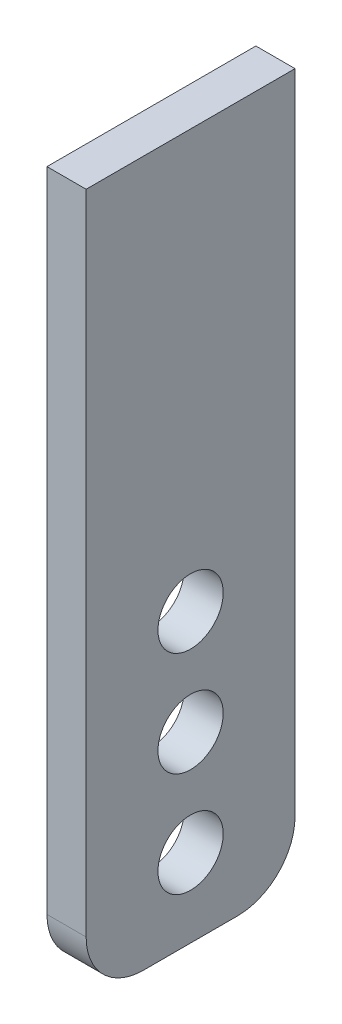
ISO-10303-21;
HEADER;
FILE_DESCRIPTION(('STEP AP214'),'2;1');
FILE_NAME('part.step','',(''),(''),'','','');
FILE_SCHEMA(('AUTOMOTIVE_DESIGN { 1 0 10303 214 1 1 1 1 }'));
ENDSEC;
DATA;
#1=APPLICATION_CONTEXT('core data for automotive mechanical design processes');
#2=APPLICATION_PROTOCOL_DEFINITION('international standard','automotive_design',2000,#1);
#3=PRODUCT_CONTEXT('',#1,'mechanical');
#4=PRODUCT('Part','Part','',(#3));
#5=PRODUCT_RELATED_PRODUCT_CATEGORY('part','',(#4));
#6=PRODUCT_DEFINITION_FORMATION('','',#4);
#7=PRODUCT_DEFINITION_CONTEXT('part definition',#1,'design');
#8=PRODUCT_DEFINITION('design','',#6,#7);
#9=PRODUCT_DEFINITION_SHAPE('','',#8);
#10=(LENGTH_UNIT() NAMED_UNIT(*) SI_UNIT(.MILLI.,.METRE.));
#11=(NAMED_UNIT(*) PLANE_ANGLE_UNIT() SI_UNIT($,.RADIAN.));
#12=(NAMED_UNIT(*) SI_UNIT($,.STERADIAN.) SOLID_ANGLE_UNIT());
#13=UNCERTAINTY_MEASURE_WITH_UNIT(LENGTH_MEASURE(1.E-05),#10,'distance_accuracy_value','');
#14=(GEOMETRIC_REPRESENTATION_CONTEXT(3) GLOBAL_UNCERTAINTY_ASSIGNED_CONTEXT((#13)) GLOBAL_UNIT_ASSIGNED_CONTEXT((#10,
#11,#12)) REPRESENTATION_CONTEXT('',''));
#15=CARTESIAN_POINT('',(0.,0.,0.));
#16=DIRECTION('',(0.,0.,1.));
#17=DIRECTION('',(1.,0.,0.));
#18=AXIS2_PLACEMENT_3D('',#15,#16,#17);
#19=CARTESIAN_POINT('',(-750.001,-200.,620.5));
#20=DIRECTION('',(1.,0.,0.));
#21=DIRECTION('',(0.,1.,0.));
#22=AXIS2_PLACEMENT_3D('',#19,#20,#21);
#23=CYLINDRICAL_SURFACE('',#22,12.5);
#24=CARTESIAN_POINT('',(342.5,-200.,620.5));
#25=DIRECTION('',(1.,0.,0.));
#26=DIRECTION('',(0.,1.,0.));
#27=AXIS2_PLACEMENT_3D('',#24,#25,#26);
#28=CIRCLE('',#27,12.5);
#29=CARTESIAN_POINT('',(342.5,-187.5,620.5));
#30=VERTEX_POINT('',#29);
#31=EDGE_CURVE('E46',#30,#30,#28,.T.);
#32=ORIENTED_EDGE('',*,*,#31,.T.);
#33=EDGE_LOOP('',(#32));
#34=FACE_BOUND('',#33,.T.);
#35=CARTESIAN_POINT('',(327.5,-200.,620.5));
#36=DIRECTION('',(1.,0.,0.));
#37=DIRECTION('',(0.,1.,0.));
#38=AXIS2_PLACEMENT_3D('',#35,#36,#37);
#39=CIRCLE('',#38,12.5);
#40=CARTESIAN_POINT('',(327.5,-187.5,620.5));
#41=VERTEX_POINT('',#40);
#42=EDGE_CURVE('E11',#41,#41,#39,.F.);
#43=ORIENTED_EDGE('',*,*,#42,.T.);
#44=EDGE_LOOP('',(#43));
#45=FACE_BOUND('',#44,.T.);
#46=ADVANCED_FACE('F38',(#34,#45),#23,.F.);
#47=CARTESIAN_POINT('',(342.5,-310.,580.5));
#48=DIRECTION('',(0.,0.,1.));
#49=DIRECTION('',(1.,0.,0.));
#50=AXIS2_PLACEMENT_3D('',#47,#48,#49);
#51=PLANE('',#50);
#52=DIRECTION('',(0.,1.,0.));
#53=VECTOR('',#52,1.);
#54=CARTESIAN_POINT('',(342.5,-310.,580.5));
#55=LINE('',#54,#53);
#56=CARTESIAN_POINT('',(342.5,-288.,580.5));
#57=VERTEX_POINT('',#56);
#58=CARTESIAN_POINT('',(342.5,-40.,580.5));
#59=VERTEX_POINT('',#58);
#60=EDGE_CURVE('E91',#57,#59,#55,.T.);
#61=ORIENTED_EDGE('',*,*,#60,.F.);
#62=DIRECTION('',(1.,0.,0.));
#63=VECTOR('',#62,1.);
#64=CARTESIAN_POINT('',(342.5,-288.,580.5));
#65=LINE('',#64,#63);
#66=CARTESIAN_POINT('',(327.5,-288.,580.5));
#67=VERTEX_POINT('',#66);
#68=EDGE_CURVE('E61',#57,#67,#65,.F.);
#69=ORIENTED_EDGE('',*,*,#68,.T.);
#70=DIRECTION('',(0.,1.,0.));
#71=VECTOR('',#70,1.);
#72=CARTESIAN_POINT('',(327.5,-310.,580.5));
#73=LINE('',#72,#71);
#74=CARTESIAN_POINT('',(327.5,-40.,580.5));
#75=VERTEX_POINT('',#74);
#76=EDGE_CURVE('E115',#67,#75,#73,.T.);
#77=ORIENTED_EDGE('',*,*,#76,.T.);
#78=DIRECTION('',(1.,0.,0.));
#79=VECTOR('',#78,1.);
#80=CARTESIAN_POINT('',(342.5,-40.,580.5));
#81=LINE('',#80,#79);
#82=EDGE_CURVE('E109',#75,#59,#81,.T.);
#83=ORIENTED_EDGE('',*,*,#82,.T.);
#84=EDGE_LOOP('',(#61,#69,#77,#83));
#85=FACE_BOUND('',#84,.T.);
#86=ADVANCED_FACE('F114',(#85),#51,.F.);
#87=CARTESIAN_POINT('',(342.5,-310.,580.5));
#88=DIRECTION('',(-1.,0.,0.));
#89=DIRECTION('',(0.,-1.,0.));
#90=AXIS2_PLACEMENT_3D('',#87,#88,#89);
#91=PLANE('',#90);
#92=CARTESIAN_POINT('',(342.5,-240.,620.5));
#93=DIRECTION('',(1.,0.,0.));
#94=DIRECTION('',(0.,1.,0.));
#95=AXIS2_PLACEMENT_3D('',#92,#93,#94);
#96=CIRCLE('',#95,12.5);
#97=CARTESIAN_POINT('',(342.5,-227.5,620.5));
#98=VERTEX_POINT('',#97);
#99=EDGE_CURVE('E297',#98,#98,#96,.T.);
#100=ORIENTED_EDGE('',*,*,#99,.F.);
#101=EDGE_LOOP('',(#100));
#102=FACE_BOUND('',#101,.T.);
#103=CARTESIAN_POINT('',(342.5,-280.,620.5));
#104=DIRECTION('',(1.,0.,0.));
#105=DIRECTION('',(0.,1.,0.));
#106=AXIS2_PLACEMENT_3D('',#103,#104,#105);
#107=CIRCLE('',#106,12.5);
#108=CARTESIAN_POINT('',(342.5,-267.5,620.5));
#109=VERTEX_POINT('',#108);
#110=EDGE_CURVE('E123',#109,#109,#107,.T.);
#111=ORIENTED_EDGE('',*,*,#110,.F.);
#112=EDGE_LOOP('',(#111));
#113=FACE_BOUND('',#112,.T.);
#114=DIRECTION('',(0.,0.,1.));
#115=VECTOR('',#114,1.);
#116=CARTESIAN_POINT('',(342.5,-310.,580.5));
#117=LINE('',#116,#115);
#118=CARTESIAN_POINT('',(342.5,-310.,602.5));
#119=VERTEX_POINT('',#118);
#120=CARTESIAN_POINT('',(342.5,-310.,638.5));
#121=VERTEX_POINT('',#120);
#122=EDGE_CURVE('E134',#119,#121,#117,.T.);
#123=ORIENTED_EDGE('',*,*,#122,.F.);
#124=CARTESIAN_POINT('',(342.5,-288.,602.5));
#125=DIRECTION('',(-1.,0.,0.));
#126=DIRECTION('',(0.,-1.,0.));
#127=AXIS2_PLACEMENT_3D('',#124,#125,#126);
#128=CIRCLE('',#127,22.);
#129=EDGE_CURVE('E99',#119,#57,#128,.F.);
#130=ORIENTED_EDGE('',*,*,#129,.T.);
#131=ORIENTED_EDGE('',*,*,#60,.T.);
#132=DIRECTION('',(0.,0.,1.));
#133=VECTOR('',#132,1.);
#134=CARTESIAN_POINT('',(342.5,-40.,580.5));
#135=LINE('',#134,#133);
#136=CARTESIAN_POINT('',(342.5,-40.,660.5));
#137=VERTEX_POINT('',#136);
#138=EDGE_CURVE('E97',#59,#137,#135,.T.);
#139=ORIENTED_EDGE('',*,*,#138,.T.);
#140=DIRECTION('',(0.,1.,0.));
#141=VECTOR('',#140,1.);
#142=CARTESIAN_POINT('',(342.5,-310.,660.5));
#143=LINE('',#142,#141);
#144=CARTESIAN_POINT('',(342.5,-288.,660.5));
#145=VERTEX_POINT('',#144);
#146=EDGE_CURVE('E103',#145,#137,#143,.T.);
#147=ORIENTED_EDGE('',*,*,#146,.F.);
#148=CARTESIAN_POINT('',(342.5,-288.,638.5));
#149=DIRECTION('',(-1.,0.,0.));
#150=DIRECTION('',(0.,-1.,0.));
#151=AXIS2_PLACEMENT_3D('',#148,#149,#150);
#152=CIRCLE('',#151,22.);
#153=EDGE_CURVE('E149',#145,#121,#152,.F.);
#154=ORIENTED_EDGE('',*,*,#153,.T.);
#155=EDGE_LOOP('',(#123,#130,#131,#139,#147,#154));
#156=FACE_BOUND('',#155,.T.);
#157=ORIENTED_EDGE('',*,*,#31,.F.);
#158=EDGE_LOOP('',(#157));
#159=FACE_BOUND('',#158,.T.);
#160=ADVANCED_FACE('F94',(#102,#113,#156,#159),#91,.F.);
#161=CARTESIAN_POINT('',(327.5,-310.,660.5));
#162=DIRECTION('',(0.,0.,-1.));
#163=DIRECTION('',(-1.,0.,0.));
#164=AXIS2_PLACEMENT_3D('',#161,#162,#163);
#165=PLANE('',#164);
#166=DIRECTION('',(0.,1.,0.));
#167=VECTOR('',#166,1.);
#168=CARTESIAN_POINT('',(327.5,-310.,660.5));
#169=LINE('',#168,#167);
#170=CARTESIAN_POINT('',(327.5,-288.,660.5));
#171=VERTEX_POINT('',#170);
#172=CARTESIAN_POINT('',(327.5,-40.,660.5));
#173=VERTEX_POINT('',#172);
#174=EDGE_CURVE('E137',#171,#173,#169,.T.);
#175=ORIENTED_EDGE('',*,*,#174,.F.);
#176=DIRECTION('',(-1.,0.,0.));
#177=VECTOR('',#176,1.);
#178=CARTESIAN_POINT('',(327.5,-288.,660.5));
#179=LINE('',#178,#177);
#180=EDGE_CURVE('E161',#171,#145,#179,.F.);
#181=ORIENTED_EDGE('',*,*,#180,.T.);
#182=ORIENTED_EDGE('',*,*,#146,.T.);
#183=DIRECTION('',(-1.,0.,0.));
#184=VECTOR('',#183,1.);
#185=CARTESIAN_POINT('',(327.5,-40.,660.5));
#186=LINE('',#185,#184);
#187=EDGE_CURVE('E111',#137,#173,#186,.T.);
#188=ORIENTED_EDGE('',*,*,#187,.T.);
#189=EDGE_LOOP('',(#175,#181,#182,#188));
#190=FACE_BOUND('',#189,.T.);
#191=ADVANCED_FACE('F171',(#190),#165,.F.);
#192=CARTESIAN_POINT('',(327.5,-310.,580.5));
#193=DIRECTION('',(1.,0.,0.));
#194=DIRECTION('',(0.,1.,0.));
#195=AXIS2_PLACEMENT_3D('',#192,#193,#194);
#196=PLANE('',#195);
#197=CARTESIAN_POINT('',(327.5,-240.,620.5));
#198=DIRECTION('',(1.,0.,0.));
#199=DIRECTION('',(0.,1.,0.));
#200=AXIS2_PLACEMENT_3D('',#197,#198,#199);
#201=CIRCLE('',#200,12.5);
#202=CARTESIAN_POINT('',(327.5,-227.5,620.5));
#203=VERTEX_POINT('',#202);
#204=EDGE_CURVE('E300',#203,#203,#201,.F.);
#205=ORIENTED_EDGE('',*,*,#204,.F.);
#206=EDGE_LOOP('',(#205));
#207=FACE_BOUND('',#206,.T.);
#208=CARTESIAN_POINT('',(327.5,-280.,620.5));
#209=DIRECTION('',(1.,0.,0.));
#210=DIRECTION('',(0.,1.,0.));
#211=AXIS2_PLACEMENT_3D('',#208,#209,#210);
#212=CIRCLE('',#211,12.5);
#213=CARTESIAN_POINT('',(327.5,-267.5,620.5));
#214=VERTEX_POINT('',#213);
#215=EDGE_CURVE('E118',#214,#214,#212,.F.);
#216=ORIENTED_EDGE('',*,*,#215,.F.);
#217=EDGE_LOOP('',(#216));
#218=FACE_BOUND('',#217,.T.);
#219=ORIENTED_EDGE('',*,*,#76,.F.);
#220=CARTESIAN_POINT('',(327.5,-288.,602.5));
#221=DIRECTION('',(1.,0.,0.));
#222=DIRECTION('',(0.,1.,0.));
#223=AXIS2_PLACEMENT_3D('',#220,#221,#222);
#224=CIRCLE('',#223,22.);
#225=CARTESIAN_POINT('',(327.5,-310.,602.5));
#226=VERTEX_POINT('',#225);
#227=EDGE_CURVE('E158',#67,#226,#224,.F.);
#228=ORIENTED_EDGE('',*,*,#227,.T.);
#229=DIRECTION('',(0.,0.,-1.));
#230=VECTOR('',#229,1.);
#231=CARTESIAN_POINT('',(327.5,-310.,580.5));
#232=LINE('',#231,#230);
#233=CARTESIAN_POINT('',(327.5,-310.,638.5));
#234=VERTEX_POINT('',#233);
#235=EDGE_CURVE('E126',#234,#226,#232,.T.);
#236=ORIENTED_EDGE('',*,*,#235,.F.);
#237=CARTESIAN_POINT('',(327.5,-288.,638.5));
#238=DIRECTION('',(1.,0.,0.));
#239=DIRECTION('',(0.,1.,0.));
#240=AXIS2_PLACEMENT_3D('',#237,#238,#239);
#241=CIRCLE('',#240,22.);
#242=EDGE_CURVE('E53',#234,#171,#241,.F.);
#243=ORIENTED_EDGE('',*,*,#242,.T.);
#244=ORIENTED_EDGE('',*,*,#174,.T.);
#245=DIRECTION('',(0.,0.,-1.));
#246=VECTOR('',#245,1.);
#247=CARTESIAN_POINT('',(327.5,-40.,580.5));
#248=LINE('',#247,#246);
#249=EDGE_CURVE('E131',#173,#75,#248,.T.);
#250=ORIENTED_EDGE('',*,*,#249,.T.);
#251=EDGE_LOOP('',(#219,#228,#236,#243,#244,#250));
#252=FACE_BOUND('',#251,.T.);
#253=ORIENTED_EDGE('',*,*,#42,.F.);
#254=EDGE_LOOP('',(#253));
#255=FACE_BOUND('',#254,.T.);
#256=ADVANCED_FACE('F178',(#207,#218,#252,#255),#196,.F.);
#257=CARTESIAN_POINT('',(1.11022302462516E-13,-310.,0.));
#258=DIRECTION('',(0.,1.,0.));
#259=DIRECTION('',(0.,0.,1.));
#260=AXIS2_PLACEMENT_3D('',#257,#258,#259);
#261=PLANE('',#260);
#262=ORIENTED_EDGE('',*,*,#235,.T.);
#263=DIRECTION('',(1.,0.,0.));
#264=VECTOR('',#263,1.);
#265=CARTESIAN_POINT('',(1.11022302462516E-13,-310.,602.5));
#266=LINE('',#265,#264);
#267=EDGE_CURVE('E145',#226,#119,#266,.T.);
#268=ORIENTED_EDGE('',*,*,#267,.T.);
#269=ORIENTED_EDGE('',*,*,#122,.T.);
#270=DIRECTION('',(-1.,0.,0.));
#271=VECTOR('',#270,1.);
#272=CARTESIAN_POINT('',(1.11022302462516E-13,-310.,638.5));
#273=LINE('',#272,#271);
#274=EDGE_CURVE('E102',#121,#234,#273,.T.);
#275=ORIENTED_EDGE('',*,*,#274,.T.);
#276=EDGE_LOOP('',(#262,#268,#269,#275));
#277=FACE_BOUND('',#276,.T.);
#278=ADVANCED_FACE('F215',(#277),#261,.F.);
#279=CARTESIAN_POINT('',(0.,-40.,0.));
#280=DIRECTION('',(0.,1.,0.));
#281=DIRECTION('',(0.,0.,1.));
#282=AXIS2_PLACEMENT_3D('',#279,#280,#281);
#283=PLANE('',#282);
#284=ORIENTED_EDGE('',*,*,#82,.F.);
#285=ORIENTED_EDGE('',*,*,#249,.F.);
#286=ORIENTED_EDGE('',*,*,#187,.F.);
#287=ORIENTED_EDGE('',*,*,#138,.F.);
#288=EDGE_LOOP('',(#284,#285,#286,#287));
#289=FACE_BOUND('',#288,.T.);
#290=ADVANCED_FACE('F107',(#289),#283,.T.);
#291=CARTESIAN_POINT('',(1.11022302462516E-13,-288.,602.5));
#292=DIRECTION('',(1.,0.,0.));
#293=DIRECTION('',(0.,0.,-1.));
#294=AXIS2_PLACEMENT_3D('',#291,#292,#293);
#295=CYLINDRICAL_SURFACE('',#294,22.);
#296=ORIENTED_EDGE('',*,*,#227,.F.);
#297=ORIENTED_EDGE('',*,*,#68,.F.);
#298=ORIENTED_EDGE('',*,*,#129,.F.);
#299=ORIENTED_EDGE('',*,*,#267,.F.);
#300=EDGE_LOOP('',(#296,#297,#298,#299));
#301=FACE_BOUND('',#300,.T.);
#302=ADVANCED_FACE('F236',(#301),#295,.T.);
#303=CARTESIAN_POINT('',(1.11022302462516E-13,-288.,638.5));
#304=DIRECTION('',(-1.,0.,0.));
#305=DIRECTION('',(0.,0.,1.));
#306=AXIS2_PLACEMENT_3D('',#303,#304,#305);
#307=CYLINDRICAL_SURFACE('',#306,22.);
#308=ORIENTED_EDGE('',*,*,#153,.F.);
#309=ORIENTED_EDGE('',*,*,#180,.F.);
#310=ORIENTED_EDGE('',*,*,#242,.F.);
#311=ORIENTED_EDGE('',*,*,#274,.F.);
#312=EDGE_LOOP('',(#308,#309,#310,#311));
#313=FACE_BOUND('',#312,.T.);
#314=ADVANCED_FACE('F246',(#313),#307,.T.);
#315=CARTESIAN_POINT('',(-750.001,-280.,620.5));
#316=DIRECTION('',(1.,0.,0.));
#317=DIRECTION('',(0.,1.,0.));
#318=AXIS2_PLACEMENT_3D('',#315,#316,#317);
#319=CYLINDRICAL_SURFACE('',#318,12.5);
#320=ORIENTED_EDGE('',*,*,#110,.T.);
#321=EDGE_LOOP('',(#320));
#322=FACE_BOUND('',#321,.T.);
#323=ORIENTED_EDGE('',*,*,#215,.T.);
#324=EDGE_LOOP('',(#323));
#325=FACE_BOUND('',#324,.T.);
#326=ADVANCED_FACE('F257',(#322,#325),#319,.F.);
#327=CARTESIAN_POINT('',(-750.001,-240.,620.5));
#328=DIRECTION('',(1.,0.,0.));
#329=DIRECTION('',(0.,1.,0.));
#330=AXIS2_PLACEMENT_3D('',#327,#328,#329);
#331=CYLINDRICAL_SURFACE('',#330,12.5);
#332=ORIENTED_EDGE('',*,*,#99,.T.);
#333=EDGE_LOOP('',(#332));
#334=FACE_BOUND('',#333,.T.);
#335=ORIENTED_EDGE('',*,*,#204,.T.);
#336=EDGE_LOOP('',(#335));
#337=FACE_BOUND('',#336,.T.);
#338=ADVANCED_FACE('F267',(#334,#337),#331,.F.);
#339=CLOSED_SHELL('',(#46,#86,#160,#191,#256,#278,#290,#302,#314,#326,#338));
#340=MANIFOLD_SOLID_BREP('B2',#339);
#341=ADVANCED_BREP_SHAPE_REPRESENTATION('',(#18,#340),#14);
#342=SHAPE_DEFINITION_REPRESENTATION(#9,#341);
ENDSEC;
END-ISO-10303-21;
